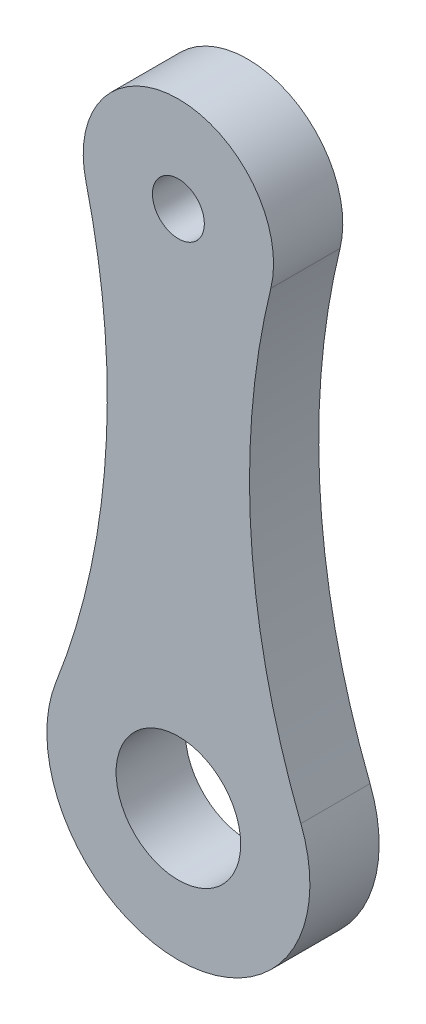
ISO-10303-21;
HEADER;
FILE_DESCRIPTION(('STEP AP214'),'2;1');
FILE_NAME('part.step','',(''),(''),'','','');
FILE_SCHEMA(('AUTOMOTIVE_DESIGN { 1 0 10303 214 1 1 1 1 }'));
ENDSEC;
DATA;
#1=APPLICATION_CONTEXT('core data for automotive mechanical design processes');
#2=APPLICATION_PROTOCOL_DEFINITION('international standard','automotive_design',2000,#1);
#3=PRODUCT_CONTEXT('',#1,'mechanical');
#4=PRODUCT('Part','Part','',(#3));
#5=PRODUCT_RELATED_PRODUCT_CATEGORY('part','',(#4));
#6=PRODUCT_DEFINITION_FORMATION('','',#4);
#7=PRODUCT_DEFINITION_CONTEXT('part definition',#1,'design');
#8=PRODUCT_DEFINITION('design','',#6,#7);
#9=PRODUCT_DEFINITION_SHAPE('','',#8);
#10=(LENGTH_UNIT() NAMED_UNIT(*) SI_UNIT(.MILLI.,.METRE.));
#11=(NAMED_UNIT(*) PLANE_ANGLE_UNIT() SI_UNIT($,.RADIAN.));
#12=(NAMED_UNIT(*) SI_UNIT($,.STERADIAN.) SOLID_ANGLE_UNIT());
#13=UNCERTAINTY_MEASURE_WITH_UNIT(LENGTH_MEASURE(1.E-05),#10,'distance_accuracy_value','');
#14=(GEOMETRIC_REPRESENTATION_CONTEXT(3) GLOBAL_UNCERTAINTY_ASSIGNED_CONTEXT((#13)) GLOBAL_UNIT_ASSIGNED_CONTEXT((#10,
#11,#12)) REPRESENTATION_CONTEXT('',''));
#15=CARTESIAN_POINT('',(0.,0.,0.));
#16=DIRECTION('',(0.,0.,1.));
#17=DIRECTION('',(1.,0.,0.));
#18=AXIS2_PLACEMENT_3D('',#15,#16,#17);
#19=CARTESIAN_POINT('',(47.1242404305022,3.46950748520222,4.));
#20=DIRECTION('',(0.,0.,-1.));
#21=DIRECTION('',(-1.,0.,0.));
#22=AXIS2_PLACEMENT_3D('',#19,#20,#21);
#23=CYLINDRICAL_SURFACE('',#22,43.0143926457458);
#24=CARTESIAN_POINT('',(47.1242404305022,3.46950748520222,0.));
#25=DIRECTION('',(0.,0.,1.));
#26=DIRECTION('',(1.,0.,0.));
#27=AXIS2_PLACEMENT_3D('',#24,#25,#26);
#28=CIRCLE('',#27,43.0143926457458);
#29=CARTESIAN_POINT('',(5.34240064098773,13.6928062916408,0.));
#30=VERTEX_POINT('',#29);
#31=CARTESIAN_POINT('',(7.07593647875019,-12.2267126097909,0.));
#32=VERTEX_POINT('',#31);
#33=EDGE_CURVE('E117',#30,#32,#28,.T.);
#34=ORIENTED_EDGE('',*,*,#33,.F.);
#35=DIRECTION('',(0.,0.,-1.));
#36=VECTOR('',#35,1.);
#37=CARTESIAN_POINT('',(5.34240064098773,13.6928062916408,4.));
#38=LINE('',#37,#36);
#39=CARTESIAN_POINT('',(5.34240064098773,13.6928062916408,4.));
#40=VERTEX_POINT('',#39);
#41=EDGE_CURVE('E11',#40,#30,#38,.T.);
#42=ORIENTED_EDGE('',*,*,#41,.F.);
#43=CARTESIAN_POINT('',(47.1242404305022,3.46950748520222,4.));
#44=DIRECTION('',(0.,0.,1.));
#45=DIRECTION('',(1.,0.,0.));
#46=AXIS2_PLACEMENT_3D('',#43,#44,#45);
#47=CIRCLE('',#46,43.0143926457458);
#48=CARTESIAN_POINT('',(7.07593647875019,-12.2267126097909,4.));
#49=VERTEX_POINT('',#48);
#50=EDGE_CURVE('E93',#40,#49,#47,.T.);
#51=ORIENTED_EDGE('',*,*,#50,.T.);
#52=DIRECTION('',(0.,0.,-1.));
#53=VECTOR('',#52,1.);
#54=CARTESIAN_POINT('',(7.07593647875019,-12.2267126097909,4.));
#55=LINE('',#54,#53);
#56=EDGE_CURVE('E81',#49,#32,#55,.T.);
#57=ORIENTED_EDGE('',*,*,#56,.T.);
#58=EDGE_LOOP('',(#34,#42,#51,#57));
#59=FACE_BOUND('',#58,.T.);
#60=ADVANCED_FACE('F41',(#59),#23,.F.);
#61=CARTESIAN_POINT('',(0.,15.,4.));
#62=DIRECTION('',(0.,0.,-1.));
#63=DIRECTION('',(-1.,0.,0.));
#64=AXIS2_PLACEMENT_3D('',#61,#62,#63);
#65=CYLINDRICAL_SURFACE('',#64,5.5);
#66=CARTESIAN_POINT('',(0.,15.,0.));
#67=DIRECTION('',(0.,0.,1.));
#68=DIRECTION('',(1.,0.,0.));
#69=AXIS2_PLACEMENT_3D('',#66,#67,#68);
#70=CIRCLE('',#69,5.5);
#71=CARTESIAN_POINT('',(-5.34240064098772,13.6928062916408,0.));
#72=VERTEX_POINT('',#71);
#73=EDGE_CURVE('E99',#30,#72,#70,.T.);
#74=ORIENTED_EDGE('',*,*,#73,.T.);
#75=DIRECTION('',(0.,0.,-1.));
#76=VECTOR('',#75,1.);
#77=CARTESIAN_POINT('',(-5.34240064098772,13.6928062916408,4.));
#78=LINE('',#77,#76);
#79=CARTESIAN_POINT('',(-5.34240064098772,13.6928062916408,4.));
#80=VERTEX_POINT('',#79);
#81=EDGE_CURVE('E50',#80,#72,#78,.T.);
#82=ORIENTED_EDGE('',*,*,#81,.F.);
#83=CARTESIAN_POINT('',(0.,15.,4.));
#84=DIRECTION('',(0.,0.,1.));
#85=DIRECTION('',(1.,0.,0.));
#86=AXIS2_PLACEMENT_3D('',#83,#84,#85);
#87=CIRCLE('',#86,5.5);
#88=EDGE_CURVE('E87',#40,#80,#87,.T.);
#89=ORIENTED_EDGE('',*,*,#88,.F.);
#90=ORIENTED_EDGE('',*,*,#41,.T.);
#91=EDGE_LOOP('',(#74,#82,#89,#90));
#92=FACE_BOUND('',#91,.T.);
#93=ADVANCED_FACE('F97',(#92),#65,.T.);
#94=CARTESIAN_POINT('',(-47.1242404305022,3.46950748520221,4.));
#95=DIRECTION('',(0.,0.,-1.));
#96=DIRECTION('',(-1.,0.,0.));
#97=AXIS2_PLACEMENT_3D('',#94,#95,#96);
#98=CYLINDRICAL_SURFACE('',#97,43.0143926457458);
#99=CARTESIAN_POINT('',(-47.1242404305022,3.46950748520221,0.));
#100=DIRECTION('',(0.,0.,1.));
#101=DIRECTION('',(1.,0.,0.));
#102=AXIS2_PLACEMENT_3D('',#99,#100,#101);
#103=CIRCLE('',#102,43.0143926457458);
#104=CARTESIAN_POINT('',(-7.07593647875018,-12.2267126097909,0.));
#105=VERTEX_POINT('',#104);
#106=EDGE_CURVE('E74',#72,#105,#103,.F.);
#107=ORIENTED_EDGE('',*,*,#106,.T.);
#108=DIRECTION('',(0.,0.,-1.));
#109=VECTOR('',#108,1.);
#110=CARTESIAN_POINT('',(-7.07593647875018,-12.2267126097909,4.));
#111=LINE('',#110,#109);
#112=CARTESIAN_POINT('',(-7.07593647875018,-12.2267126097909,4.));
#113=VERTEX_POINT('',#112);
#114=EDGE_CURVE('E101',#113,#105,#111,.T.);
#115=ORIENTED_EDGE('',*,*,#114,.F.);
#116=CARTESIAN_POINT('',(-47.1242404305022,3.46950748520221,4.));
#117=DIRECTION('',(0.,0.,1.));
#118=DIRECTION('',(1.,0.,0.));
#119=AXIS2_PLACEMENT_3D('',#116,#117,#118);
#120=CIRCLE('',#119,43.0143926457458);
#121=EDGE_CURVE('E92',#80,#113,#120,.F.);
#122=ORIENTED_EDGE('',*,*,#121,.F.);
#123=ORIENTED_EDGE('',*,*,#81,.T.);
#124=EDGE_LOOP('',(#107,#115,#122,#123));
#125=FACE_BOUND('',#124,.T.);
#126=ADVANCED_FACE('F102',(#125),#98,.F.);
#127=CARTESIAN_POINT('',(0.,15.,4.));
#128=DIRECTION('',(0.,0.,-1.));
#129=DIRECTION('',(-1.,0.,0.));
#130=AXIS2_PLACEMENT_3D('',#127,#128,#129);
#131=CYLINDRICAL_SURFACE('',#130,1.5);
#132=CARTESIAN_POINT('',(0.,15.,4.));
#133=DIRECTION('',(0.,0.,1.));
#134=DIRECTION('',(1.,0.,0.));
#135=AXIS2_PLACEMENT_3D('',#132,#133,#134);
#136=CIRCLE('',#135,1.5);
#137=CARTESIAN_POINT('',(1.50000000000001,15.,4.));
#138=VERTEX_POINT('',#137);
#139=EDGE_CURVE('E106',#138,#138,#136,.T.);
#140=ORIENTED_EDGE('',*,*,#139,.T.);
#141=EDGE_LOOP('',(#140));
#142=FACE_BOUND('',#141,.T.);
#143=CARTESIAN_POINT('',(0.,15.,0.));
#144=DIRECTION('',(0.,0.,1.));
#145=DIRECTION('',(1.,0.,0.));
#146=AXIS2_PLACEMENT_3D('',#143,#144,#145);
#147=CIRCLE('',#146,1.5);
#148=CARTESIAN_POINT('',(1.50000000000001,15.,0.));
#149=VERTEX_POINT('',#148);
#150=EDGE_CURVE('E128',#149,#149,#147,.T.);
#151=ORIENTED_EDGE('',*,*,#150,.F.);
#152=EDGE_LOOP('',(#151));
#153=FACE_BOUND('',#152,.T.);
#154=ADVANCED_FACE('F152',(#142,#153),#131,.F.);
#155=CARTESIAN_POINT('',(0.,-15.,4.));
#156=DIRECTION('',(0.,0.,-1.));
#157=DIRECTION('',(-1.,0.,0.));
#158=AXIS2_PLACEMENT_3D('',#155,#156,#157);
#159=CYLINDRICAL_SURFACE('',#158,7.60000000000001);
#160=CARTESIAN_POINT('',(0.,-15.,0.));
#161=DIRECTION('',(0.,0.,1.));
#162=DIRECTION('',(1.,0.,0.));
#163=AXIS2_PLACEMENT_3D('',#160,#161,#162);
#164=CIRCLE('',#163,7.60000000000001);
#165=EDGE_CURVE('E125',#105,#32,#164,.T.);
#166=ORIENTED_EDGE('',*,*,#165,.T.);
#167=ORIENTED_EDGE('',*,*,#56,.F.);
#168=CARTESIAN_POINT('',(0.,-15.,4.));
#169=DIRECTION('',(0.,0.,1.));
#170=DIRECTION('',(1.,0.,0.));
#171=AXIS2_PLACEMENT_3D('',#168,#169,#170);
#172=CIRCLE('',#171,7.60000000000001);
#173=EDGE_CURVE('E58',#113,#49,#172,.T.);
#174=ORIENTED_EDGE('',*,*,#173,.F.);
#175=ORIENTED_EDGE('',*,*,#114,.T.);
#176=EDGE_LOOP('',(#166,#167,#174,#175));
#177=FACE_BOUND('',#176,.T.);
#178=ADVANCED_FACE('F141',(#177),#159,.T.);
#179=CARTESIAN_POINT('',(0.,-15.,4.));
#180=DIRECTION('',(0.,0.,-1.));
#181=DIRECTION('',(-1.,0.,0.));
#182=AXIS2_PLACEMENT_3D('',#179,#180,#181);
#183=CYLINDRICAL_SURFACE('',#182,3.6);
#184=CARTESIAN_POINT('',(0.,-15.,4.));
#185=DIRECTION('',(0.,0.,1.));
#186=DIRECTION('',(1.,0.,0.));
#187=AXIS2_PLACEMENT_3D('',#184,#185,#186);
#188=CIRCLE('',#187,3.6);
#189=CARTESIAN_POINT('',(3.6,-15.,4.));
#190=VERTEX_POINT('',#189);
#191=EDGE_CURVE('E113',#190,#190,#188,.T.);
#192=ORIENTED_EDGE('',*,*,#191,.T.);
#193=EDGE_LOOP('',(#192));
#194=FACE_BOUND('',#193,.T.);
#195=CARTESIAN_POINT('',(0.,-15.,0.));
#196=DIRECTION('',(0.,0.,1.));
#197=DIRECTION('',(1.,0.,0.));
#198=AXIS2_PLACEMENT_3D('',#195,#196,#197);
#199=CIRCLE('',#198,3.6);
#200=CARTESIAN_POINT('',(3.6,-15.,0.));
#201=VERTEX_POINT('',#200);
#202=EDGE_CURVE('E132',#201,#201,#199,.T.);
#203=ORIENTED_EDGE('',*,*,#202,.F.);
#204=EDGE_LOOP('',(#203));
#205=FACE_BOUND('',#204,.T.);
#206=ADVANCED_FACE('F157',(#194,#205),#183,.F.);
#207=CARTESIAN_POINT('',(0.,0.,4.));
#208=DIRECTION('',(0.,0.,1.));
#209=DIRECTION('',(1.,0.,0.));
#210=AXIS2_PLACEMENT_3D('',#207,#208,#209);
#211=PLANE('',#210);
#212=ORIENTED_EDGE('',*,*,#50,.F.);
#213=ORIENTED_EDGE('',*,*,#88,.T.);
#214=ORIENTED_EDGE('',*,*,#121,.T.);
#215=ORIENTED_EDGE('',*,*,#173,.T.);
#216=EDGE_LOOP('',(#212,#213,#214,#215));
#217=FACE_BOUND('',#216,.T.);
#218=ORIENTED_EDGE('',*,*,#139,.F.);
#219=EDGE_LOOP('',(#218));
#220=FACE_BOUND('',#219,.T.);
#221=ORIENTED_EDGE('',*,*,#191,.F.);
#222=EDGE_LOOP('',(#221));
#223=FACE_BOUND('',#222,.T.);
#224=ADVANCED_FACE('F89',(#217,#220,#223),#211,.T.);
#225=CARTESIAN_POINT('',(0.,0.,0.));
#226=DIRECTION('',(0.,0.,1.));
#227=DIRECTION('',(1.,0.,0.));
#228=AXIS2_PLACEMENT_3D('',#225,#226,#227);
#229=PLANE('',#228);
#230=ORIENTED_EDGE('',*,*,#33,.T.);
#231=ORIENTED_EDGE('',*,*,#165,.F.);
#232=ORIENTED_EDGE('',*,*,#106,.F.);
#233=ORIENTED_EDGE('',*,*,#73,.F.);
#234=EDGE_LOOP('',(#230,#231,#232,#233));
#235=FACE_BOUND('',#234,.T.);
#236=ORIENTED_EDGE('',*,*,#150,.T.);
#237=EDGE_LOOP('',(#236));
#238=FACE_BOUND('',#237,.T.);
#239=ORIENTED_EDGE('',*,*,#202,.T.);
#240=EDGE_LOOP('',(#239));
#241=FACE_BOUND('',#240,.T.);
#242=ADVANCED_FACE('F143',(#235,#238,#241),#229,.F.);
#243=CLOSED_SHELL('',(#60,#93,#126,#154,#178,#206,#224,#242));
#244=MANIFOLD_SOLID_BREP('B2',#243);
#245=ADVANCED_BREP_SHAPE_REPRESENTATION('',(#18,#244),#14);
#246=SHAPE_DEFINITION_REPRESENTATION(#9,#245);
ENDSEC;
END-ISO-10303-21;
